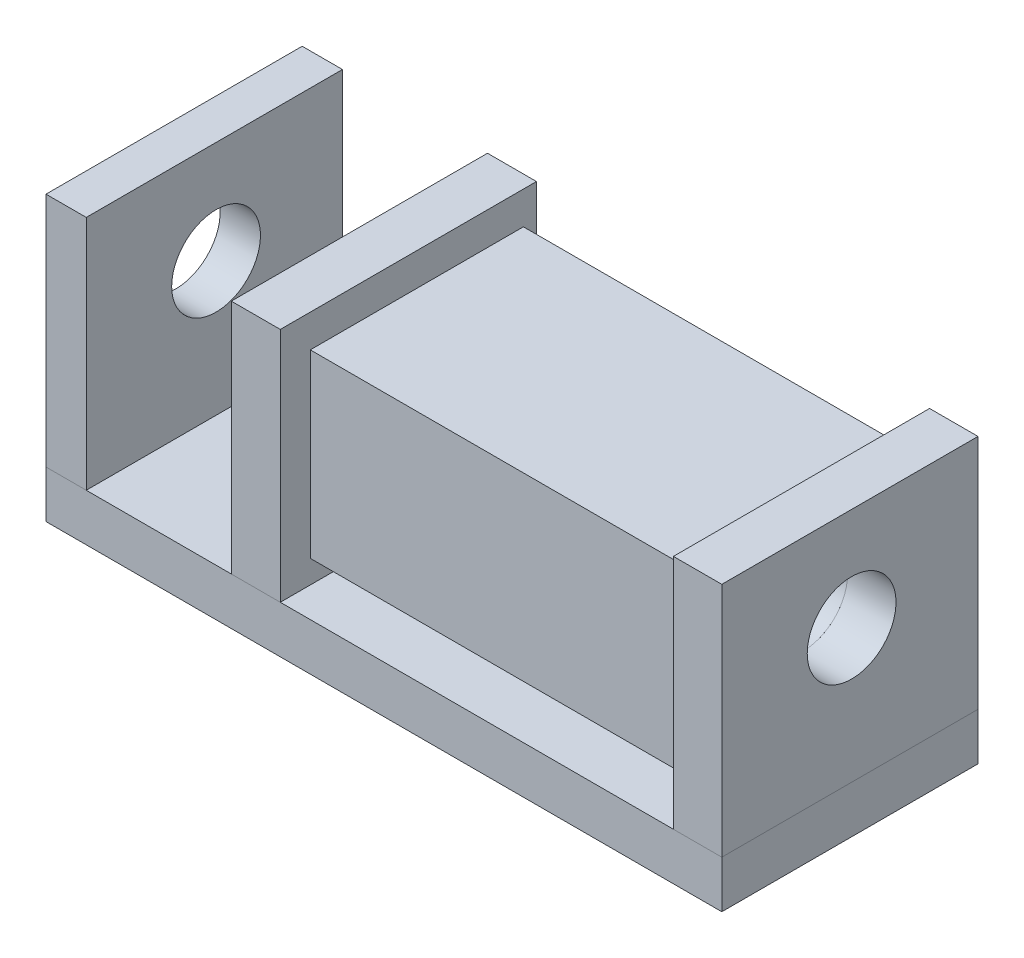
ISO-10303-21;
HEADER;
FILE_DESCRIPTION(('STEP AP214'),'2;1');
FILE_NAME('part.step','',(''),(''),'','','');
FILE_SCHEMA(('AUTOMOTIVE_DESIGN { 1 0 10303 214 1 1 1 1 }'));
ENDSEC;
DATA;
#1=APPLICATION_CONTEXT('core data for automotive mechanical design processes');
#2=APPLICATION_PROTOCOL_DEFINITION('international standard','automotive_design',2000,#1);
#3=PRODUCT_CONTEXT('',#1,'mechanical');
#4=PRODUCT('Part','Part','',(#3));
#5=PRODUCT_RELATED_PRODUCT_CATEGORY('part','',(#4));
#6=PRODUCT_DEFINITION_FORMATION('','',#4);
#7=PRODUCT_DEFINITION_CONTEXT('part definition',#1,'design');
#8=PRODUCT_DEFINITION('design','',#6,#7);
#9=PRODUCT_DEFINITION_SHAPE('','',#8);
#10=(LENGTH_UNIT() NAMED_UNIT(*) SI_UNIT(.MILLI.,.METRE.));
#11=(NAMED_UNIT(*) PLANE_ANGLE_UNIT() SI_UNIT($,.RADIAN.));
#12=(NAMED_UNIT(*) SI_UNIT($,.STERADIAN.) SOLID_ANGLE_UNIT());
#13=UNCERTAINTY_MEASURE_WITH_UNIT(LENGTH_MEASURE(1.E-05),#10,'distance_accuracy_value','');
#14=(GEOMETRIC_REPRESENTATION_CONTEXT(3) GLOBAL_UNCERTAINTY_ASSIGNED_CONTEXT((#13)) GLOBAL_UNIT_ASSIGNED_CONTEXT((#10,
#11,#12)) REPRESENTATION_CONTEXT('',''));
#15=CARTESIAN_POINT('',(0.,0.,0.));
#16=DIRECTION('',(0.,0.,1.));
#17=DIRECTION('',(1.,0.,0.));
#18=AXIS2_PLACEMENT_3D('',#15,#16,#17);
#19=CARTESIAN_POINT('',(132.746933466122,60.,0.));
#20=DIRECTION('',(1.,0.,0.));
#21=DIRECTION('',(0.,0.,-1.));
#22=AXIS2_PLACEMENT_3D('',#19,#20,#21);
#23=PLANE('',#22);
#24=CARTESIAN_POINT('',(132.746933466122,38.2969215715457,-27.4639647561201));
#25=DIRECTION('',(1.,0.,0.));
#26=DIRECTION('',(0.,0.,-1.));
#27=AXIS2_PLACEMENT_3D('',#24,#25,#26);
#28=CIRCLE('',#27,9.39188455367871);
#29=CARTESIAN_POINT('',(132.746933466122,38.2969215715457,-36.8558493097988));
#30=VERTEX_POINT('',#29);
#31=EDGE_CURVE('E103',#30,#30,#28,.T.);
#32=ORIENTED_EDGE('',*,*,#31,.F.);
#33=EDGE_LOOP('',(#32));
#34=FACE_BOUND('',#33,.T.);
#35=DIRECTION('',(0.,-1.,0.));
#36=VECTOR('',#35,1.);
#37=CARTESIAN_POINT('',(132.746933466137,53.0819568307948,-6.34781427334019));
#38=LINE('',#37,#36);
#39=CARTESIAN_POINT('',(132.746933466137,53.0819568307948,-6.34781427334019));
#40=VERTEX_POINT('',#39);
#41=CARTESIAN_POINT('',(132.746933466137,14.8769483537876,-6.34781427334019));
#42=VERTEX_POINT('',#41);
#43=EDGE_CURVE('E87',#40,#42,#38,.T.);
#44=ORIENTED_EDGE('',*,*,#43,.T.);
#45=DIRECTION('',(0.,0.,-1.));
#46=VECTOR('',#45,1.);
#47=CARTESIAN_POINT('',(132.746933466137,14.8769483537876,-6.34781427334019));
#48=LINE('',#47,#46);
#49=CARTESIAN_POINT('',(132.746933466137,14.8769483537876,-51.4371231705013));
#50=VERTEX_POINT('',#49);
#51=EDGE_CURVE('E116',#42,#50,#48,.T.);
#52=ORIENTED_EDGE('',*,*,#51,.T.);
#53=DIRECTION('',(0.,1.,0.));
#54=VECTOR('',#53,1.);
#55=CARTESIAN_POINT('',(132.746933466137,53.0819568307948,-51.4371231705013));
#56=LINE('',#55,#54);
#57=CARTESIAN_POINT('',(132.746933466137,53.0819568307948,-51.4371231705013));
#58=VERTEX_POINT('',#57);
#59=EDGE_CURVE('E51',#50,#58,#56,.T.);
#60=ORIENTED_EDGE('',*,*,#59,.T.);
#61=DIRECTION('',(0.,0.,1.));
#62=VECTOR('',#61,1.);
#63=CARTESIAN_POINT('',(132.746933466137,53.0819568307948,-6.34781427334019));
#64=LINE('',#63,#62);
#65=EDGE_CURVE('E12',#58,#40,#64,.T.);
#66=ORIENTED_EDGE('',*,*,#65,.T.);
#67=EDGE_LOOP('',(#44,#52,#60,#66));
#68=FACE_BOUND('',#67,.T.);
#69=ADVANCED_FACE('F43',(#34,#68),#23,.T.);
#70=CARTESIAN_POINT('',(500000.,14.8769483537876,-6.34781427334019));
#71=DIRECTION('',(0.,1.,0.));
#72=DIRECTION('',(0.,0.,1.));
#73=AXIS2_PLACEMENT_3D('',#70,#71,#72);
#74=PLANE('',#73);
#75=ORIENTED_EDGE('',*,*,#51,.F.);
#76=DIRECTION('',(-1.,0.,0.));
#77=VECTOR('',#76,1.);
#78=CARTESIAN_POINT('',(500000.,14.8769483537876,-6.34781427334019));
#79=LINE('',#78,#77);
#80=CARTESIAN_POINT('',(49.5738244185297,14.8769483537876,-6.34781427334019));
#81=VERTEX_POINT('',#80);
#82=EDGE_CURVE('E110',#42,#81,#79,.T.);
#83=ORIENTED_EDGE('',*,*,#82,.T.);
#84=DIRECTION('',(0.,0.,-1.));
#85=VECTOR('',#84,1.);
#86=CARTESIAN_POINT('',(49.5738244185297,14.8769483537876,-6.34781427334019));
#87=LINE('',#86,#85);
#88=CARTESIAN_POINT('',(49.5738244185297,14.8769483537876,-51.4371231705013));
#89=VERTEX_POINT('',#88);
#90=EDGE_CURVE('E102',#81,#89,#87,.T.);
#91=ORIENTED_EDGE('',*,*,#90,.T.);
#92=DIRECTION('',(-1.,0.,0.));
#93=VECTOR('',#92,1.);
#94=CARTESIAN_POINT('',(500000.,14.8769483537876,-51.4371231705013));
#95=LINE('',#94,#93);
#96=EDGE_CURVE('E112',#50,#89,#95,.T.);
#97=ORIENTED_EDGE('',*,*,#96,.F.);
#98=EDGE_LOOP('',(#75,#83,#91,#97));
#99=FACE_BOUND('',#98,.T.);
#100=ADVANCED_FACE('F120',(#99),#74,.F.);
#101=CARTESIAN_POINT('',(500000.,53.0819568307948,-6.34781427334019));
#102=DIRECTION('',(0.,0.,-1.));
#103=DIRECTION('',(-1.,0.,0.));
#104=AXIS2_PLACEMENT_3D('',#101,#102,#103);
#105=PLANE('',#104);
#106=ORIENTED_EDGE('',*,*,#43,.F.);
#107=DIRECTION('',(-1.,0.,0.));
#108=VECTOR('',#107,1.);
#109=CARTESIAN_POINT('',(500000.,53.0819568307948,-6.34781427334019));
#110=LINE('',#109,#108);
#111=CARTESIAN_POINT('',(49.5738244185297,53.0819568307948,-6.34781427334019));
#112=VERTEX_POINT('',#111);
#113=EDGE_CURVE('E81',#40,#112,#110,.T.);
#114=ORIENTED_EDGE('',*,*,#113,.T.);
#115=DIRECTION('',(0.,-1.,0.));
#116=VECTOR('',#115,1.);
#117=CARTESIAN_POINT('',(49.5738244185297,53.0819568307948,-6.34781427334019));
#118=LINE('',#117,#116);
#119=EDGE_CURVE('E86',#112,#81,#118,.T.);
#120=ORIENTED_EDGE('',*,*,#119,.T.);
#121=ORIENTED_EDGE('',*,*,#82,.F.);
#122=EDGE_LOOP('',(#106,#114,#120,#121));
#123=FACE_BOUND('',#122,.T.);
#124=ADVANCED_FACE('F83',(#123),#105,.F.);
#125=CARTESIAN_POINT('',(49.5738244185297,0.,0.));
#126=DIRECTION('',(1.,0.,0.));
#127=DIRECTION('',(0.,0.,-1.));
#128=AXIS2_PLACEMENT_3D('',#125,#126,#127);
#129=PLANE('',#128);
#130=CARTESIAN_POINT('',(49.5738244185297,38.2969215715457,-27.4639647561201));
#131=DIRECTION('',(1.,0.,0.));
#132=DIRECTION('',(0.,0.,-1.));
#133=AXIS2_PLACEMENT_3D('',#130,#131,#132);
#134=CIRCLE('',#133,9.39188455367871);
#135=CARTESIAN_POINT('',(49.5738244185297,38.2969215715457,-36.8558493097988));
#136=VERTEX_POINT('',#135);
#137=EDGE_CURVE('E46',#136,#136,#134,.T.);
#138=ORIENTED_EDGE('',*,*,#137,.T.);
#139=EDGE_LOOP('',(#138));
#140=FACE_BOUND('',#139,.T.);
#141=ORIENTED_EDGE('',*,*,#119,.F.);
#142=DIRECTION('',(0.,0.,1.));
#143=VECTOR('',#142,1.);
#144=CARTESIAN_POINT('',(49.5738244185297,53.0819568307948,-6.34781427334019));
#145=LINE('',#144,#143);
#146=CARTESIAN_POINT('',(49.5738244185297,53.0819568307948,-51.4371231705013));
#147=VERTEX_POINT('',#146);
#148=EDGE_CURVE('E89',#147,#112,#145,.T.);
#149=ORIENTED_EDGE('',*,*,#148,.F.);
#150=DIRECTION('',(0.,1.,0.));
#151=VECTOR('',#150,1.);
#152=CARTESIAN_POINT('',(49.5738244185297,53.0819568307948,-51.4371231705013));
#153=LINE('',#152,#151);
#154=EDGE_CURVE('E97',#89,#147,#153,.T.);
#155=ORIENTED_EDGE('',*,*,#154,.F.);
#156=ORIENTED_EDGE('',*,*,#90,.F.);
#157=EDGE_LOOP('',(#141,#149,#155,#156));
#158=FACE_BOUND('',#157,.T.);
#159=ADVANCED_FACE('F100',(#140,#158),#129,.F.);
#160=CARTESIAN_POINT('',(500000.,53.0819568307948,-51.4371231705013));
#161=DIRECTION('',(0.,0.,1.));
#162=DIRECTION('',(1.,0.,0.));
#163=AXIS2_PLACEMENT_3D('',#160,#161,#162);
#164=PLANE('',#163);
#165=ORIENTED_EDGE('',*,*,#59,.F.);
#166=ORIENTED_EDGE('',*,*,#96,.T.);
#167=ORIENTED_EDGE('',*,*,#154,.T.);
#168=DIRECTION('',(-1.,0.,0.));
#169=VECTOR('',#168,1.);
#170=CARTESIAN_POINT('',(500000.,53.0819568307948,-51.4371231705013));
#171=LINE('',#170,#169);
#172=EDGE_CURVE('E88',#58,#147,#171,.T.);
#173=ORIENTED_EDGE('',*,*,#172,.F.);
#174=EDGE_LOOP('',(#165,#166,#167,#173));
#175=FACE_BOUND('',#174,.T.);
#176=ADVANCED_FACE('F122',(#175),#164,.F.);
#177=CARTESIAN_POINT('',(500000.,53.0819568307948,-6.34781427334019));
#178=DIRECTION('',(0.,-1.,0.));
#179=DIRECTION('',(0.,0.,-1.));
#180=AXIS2_PLACEMENT_3D('',#177,#178,#179);
#181=PLANE('',#180);
#182=ORIENTED_EDGE('',*,*,#65,.F.);
#183=ORIENTED_EDGE('',*,*,#172,.T.);
#184=ORIENTED_EDGE('',*,*,#148,.T.);
#185=ORIENTED_EDGE('',*,*,#113,.F.);
#186=EDGE_LOOP('',(#182,#183,#184,#185));
#187=FACE_BOUND('',#186,.T.);
#188=ADVANCED_FACE('F92',(#187),#181,.F.);
#189=CARTESIAN_POINT('',(169.557159039612,38.2969215715457,-27.4639647561201));
#190=DIRECTION('',(-1.,0.,0.));
#191=DIRECTION('',(0.,0.,1.));
#192=AXIS2_PLACEMENT_3D('',#189,#190,#191);
#193=CYLINDRICAL_SURFACE('',#192,9.39188455367871);
#194=ORIENTED_EDGE('',*,*,#31,.T.);
#195=EDGE_LOOP('',(#194));
#196=FACE_BOUND('',#195,.T.);
#197=ORIENTED_EDGE('',*,*,#137,.F.);
#198=EDGE_LOOP('',(#197));
#199=FACE_BOUND('',#198,.T.);
#200=ADVANCED_FACE('F129',(#196,#199),#193,.F.);
#201=CLOSED_SHELL('',(#69,#100,#124,#159,#176,#188,#200));
#202=MANIFOLD_SOLID_BREP('B2',#201);
#203=CARTESIAN_POINT('',(39.2104018854431,60.,-54.2064580712363));
#204=DIRECTION('',(1.,0.,0.));
#205=DIRECTION('',(0.,0.,-1.));
#206=AXIS2_PLACEMENT_3D('',#203,#204,#205);
#207=PLANE('',#206);
#208=CARTESIAN_POINT('',(39.2104018854431,38.2969215715457,-27.4639647561201));
#209=DIRECTION('',(1.,0.,0.));
#210=DIRECTION('',(0.,0.,-1.));
#211=AXIS2_PLACEMENT_3D('',#208,#209,#210);
#212=CIRCLE('',#211,9.39188455367871);
#213=CARTESIAN_POINT('',(39.2104018854431,38.2969215715457,-36.8558493097988));
#214=VERTEX_POINT('',#213);
#215=EDGE_CURVE('E265',#214,#214,#212,.T.);
#216=ORIENTED_EDGE('',*,*,#215,.T.);
#217=EDGE_LOOP('',(#216));
#218=FACE_BOUND('',#217,.T.);
#219=DIRECTION('',(0.,0.,1.));
#220=VECTOR('',#219,1.);
#221=CARTESIAN_POINT('',(39.2104018854431,10.,-54.2064580712363));
#222=LINE('',#221,#220);
#223=CARTESIAN_POINT('',(39.2104018854431,10.,-54.2064580712363));
#224=VERTEX_POINT('',#223);
#225=CARTESIAN_POINT('',(39.2104018854431,10.,0.));
#226=VERTEX_POINT('',#225);
#227=EDGE_CURVE('E262',#224,#226,#222,.T.);
#228=ORIENTED_EDGE('',*,*,#227,.T.);
#229=DIRECTION('',(0.,-1.,0.));
#230=VECTOR('',#229,1.);
#231=CARTESIAN_POINT('',(39.2104018854431,60.,0.));
#232=LINE('',#231,#230);
#233=CARTESIAN_POINT('',(39.2104018854431,60.,0.));
#234=VERTEX_POINT('',#233);
#235=EDGE_CURVE('E41',#234,#226,#232,.T.);
#236=ORIENTED_EDGE('',*,*,#235,.F.);
#237=DIRECTION('',(0.,0.,1.));
#238=VECTOR('',#237,1.);
#239=CARTESIAN_POINT('',(39.2104018854431,60.,-54.2064580712363));
#240=LINE('',#239,#238);
#241=CARTESIAN_POINT('',(39.2104018854431,60.,-54.2064580712363));
#242=VERTEX_POINT('',#241);
#243=EDGE_CURVE('E249',#242,#234,#240,.T.);
#244=ORIENTED_EDGE('',*,*,#243,.F.);
#245=DIRECTION('',(0.,-1.,0.));
#246=VECTOR('',#245,1.);
#247=CARTESIAN_POINT('',(39.2104018854431,60.,-54.2064580712363));
#248=LINE('',#247,#246);
#249=EDGE_CURVE('E258',#242,#224,#248,.T.);
#250=ORIENTED_EDGE('',*,*,#249,.T.);
#251=EDGE_LOOP('',(#228,#236,#244,#250));
#252=FACE_BOUND('',#251,.T.);
#253=ADVANCED_FACE('F197',(#218,#252),#207,.F.);
#254=CARTESIAN_POINT('',(39.2104018854431,60.,0.));
#255=DIRECTION('',(0.,0.,-1.));
#256=DIRECTION('',(-1.,0.,0.));
#257=AXIS2_PLACEMENT_3D('',#254,#255,#256);
#258=PLANE('',#257);
#259=DIRECTION('',(1.,0.,0.));
#260=VECTOR('',#259,1.);
#261=CARTESIAN_POINT('',(39.2104018854431,10.,0.));
#262=LINE('',#261,#260);
#263=CARTESIAN_POINT('',(49.5738244185297,10.,0.));
#264=VERTEX_POINT('',#263);
#265=EDGE_CURVE('E253',#226,#264,#262,.T.);
#266=ORIENTED_EDGE('',*,*,#265,.T.);
#267=DIRECTION('',(0.,-1.,0.));
#268=VECTOR('',#267,1.);
#269=CARTESIAN_POINT('',(49.5738244185297,60.,0.));
#270=LINE('',#269,#268);
#271=CARTESIAN_POINT('',(49.5738244185297,60.,0.));
#272=VERTEX_POINT('',#271);
#273=EDGE_CURVE('E206',#272,#264,#270,.T.);
#274=ORIENTED_EDGE('',*,*,#273,.F.);
#275=DIRECTION('',(1.,0.,0.));
#276=VECTOR('',#275,1.);
#277=CARTESIAN_POINT('',(39.2104018854431,60.,0.));
#278=LINE('',#277,#276);
#279=EDGE_CURVE('E244',#234,#272,#278,.T.);
#280=ORIENTED_EDGE('',*,*,#279,.F.);
#281=ORIENTED_EDGE('',*,*,#235,.T.);
#282=EDGE_LOOP('',(#266,#274,#280,#281));
#283=FACE_BOUND('',#282,.T.);
#284=ADVANCED_FACE('F252',(#283),#258,.F.);
#285=CARTESIAN_POINT('',(49.5738244185297,60.,-54.2064580712363));
#286=DIRECTION('',(-1.,0.,0.));
#287=DIRECTION('',(0.,0.,1.));
#288=AXIS2_PLACEMENT_3D('',#285,#286,#287);
#289=PLANE('',#288);
#290=CARTESIAN_POINT('',(49.5738244185297,38.2969215715457,-27.4639647561201));
#291=DIRECTION('',(-1.,0.,0.));
#292=DIRECTION('',(0.,0.,1.));
#293=AXIS2_PLACEMENT_3D('',#290,#291,#292);
#294=CIRCLE('',#293,9.39188455367871);
#295=CARTESIAN_POINT('',(49.5738244185297,38.2969215715457,-18.0720802024414));
#296=VERTEX_POINT('',#295);
#297=EDGE_CURVE('E200',#296,#296,#294,.T.);
#298=ORIENTED_EDGE('',*,*,#297,.T.);
#299=EDGE_LOOP('',(#298));
#300=FACE_BOUND('',#299,.T.);
#301=DIRECTION('',(0.,0.,-1.));
#302=VECTOR('',#301,1.);
#303=CARTESIAN_POINT('',(49.5738244185297,10.,-54.2064580712363));
#304=LINE('',#303,#302);
#305=CARTESIAN_POINT('',(49.5738244185297,10.,-54.2064580712363));
#306=VERTEX_POINT('',#305);
#307=EDGE_CURVE('E231',#264,#306,#304,.T.);
#308=ORIENTED_EDGE('',*,*,#307,.T.);
#309=DIRECTION('',(0.,-1.,0.));
#310=VECTOR('',#309,1.);
#311=CARTESIAN_POINT('',(49.5738244185297,60.,-54.2064580712363));
#312=LINE('',#311,#310);
#313=CARTESIAN_POINT('',(49.5738244185297,60.,-54.2064580712363));
#314=VERTEX_POINT('',#313);
#315=EDGE_CURVE('E254',#314,#306,#312,.T.);
#316=ORIENTED_EDGE('',*,*,#315,.F.);
#317=DIRECTION('',(0.,0.,-1.));
#318=VECTOR('',#317,1.);
#319=CARTESIAN_POINT('',(49.5738244185297,60.,-54.2064580712363));
#320=LINE('',#319,#318);
#321=EDGE_CURVE('E247',#272,#314,#320,.T.);
#322=ORIENTED_EDGE('',*,*,#321,.F.);
#323=ORIENTED_EDGE('',*,*,#273,.T.);
#324=EDGE_LOOP('',(#308,#316,#322,#323));
#325=FACE_BOUND('',#324,.T.);
#326=ADVANCED_FACE('F256',(#300,#325),#289,.F.);
#327=CARTESIAN_POINT('',(39.2104018854431,60.,-54.2064580712363));
#328=DIRECTION('',(0.,0.,1.));
#329=DIRECTION('',(1.,0.,0.));
#330=AXIS2_PLACEMENT_3D('',#327,#328,#329);
#331=PLANE('',#330);
#332=DIRECTION('',(-1.,0.,0.));
#333=VECTOR('',#332,1.);
#334=CARTESIAN_POINT('',(39.2104018854431,10.,-54.2064580712363));
#335=LINE('',#334,#333);
#336=EDGE_CURVE('E237',#306,#224,#335,.T.);
#337=ORIENTED_EDGE('',*,*,#336,.T.);
#338=ORIENTED_EDGE('',*,*,#249,.F.);
#339=DIRECTION('',(-1.,0.,0.));
#340=VECTOR('',#339,1.);
#341=CARTESIAN_POINT('',(39.2104018854431,60.,-54.2064580712363));
#342=LINE('',#341,#340);
#343=EDGE_CURVE('E214',#314,#242,#342,.T.);
#344=ORIENTED_EDGE('',*,*,#343,.F.);
#345=ORIENTED_EDGE('',*,*,#315,.T.);
#346=EDGE_LOOP('',(#337,#338,#344,#345));
#347=FACE_BOUND('',#346,.T.);
#348=ADVANCED_FACE('F270',(#347),#331,.F.);
#349=CARTESIAN_POINT('',(0.,60.,0.));
#350=DIRECTION('',(0.,1.,0.));
#351=DIRECTION('',(0.,0.,1.));
#352=AXIS2_PLACEMENT_3D('',#349,#350,#351);
#353=PLANE('',#352);
#354=ORIENTED_EDGE('',*,*,#243,.T.);
#355=ORIENTED_EDGE('',*,*,#279,.T.);
#356=ORIENTED_EDGE('',*,*,#321,.T.);
#357=ORIENTED_EDGE('',*,*,#343,.T.);
#358=EDGE_LOOP('',(#354,#355,#356,#357));
#359=FACE_BOUND('',#358,.T.);
#360=ADVANCED_FACE('F245',(#359),#353,.T.);
#361=CARTESIAN_POINT('',(0.,10.,0.));
#362=DIRECTION('',(0.,1.,0.));
#363=DIRECTION('',(0.,0.,1.));
#364=AXIS2_PLACEMENT_3D('',#361,#362,#363);
#365=PLANE('',#364);
#366=ORIENTED_EDGE('',*,*,#227,.F.);
#367=ORIENTED_EDGE('',*,*,#336,.F.);
#368=ORIENTED_EDGE('',*,*,#307,.F.);
#369=ORIENTED_EDGE('',*,*,#265,.F.);
#370=EDGE_LOOP('',(#366,#367,#368,#369));
#371=FACE_BOUND('',#370,.T.);
#372=ADVANCED_FACE('F273',(#371),#365,.F.);
#373=CARTESIAN_POINT('',(169.557159039612,38.2969215715457,-27.4639647561201));
#374=DIRECTION('',(-1.,0.,0.));
#375=DIRECTION('',(0.,0.,1.));
#376=AXIS2_PLACEMENT_3D('',#373,#374,#375);
#377=CYLINDRICAL_SURFACE('',#376,9.39188455367871);
#378=ORIENTED_EDGE('',*,*,#297,.F.);
#379=EDGE_LOOP('',(#378));
#380=FACE_BOUND('',#379,.T.);
#381=ORIENTED_EDGE('',*,*,#215,.F.);
#382=EDGE_LOOP('',(#381));
#383=FACE_BOUND('',#382,.T.);
#384=ADVANCED_FACE('F283',(#380,#383),#377,.F.);
#385=CLOSED_SHELL('',(#253,#284,#326,#348,#360,#372,#384));
#386=MANIFOLD_SOLID_BREP('B6',#385);
#387=CARTESIAN_POINT('',(142.992898015503,60.,0.));
#388=DIRECTION('',(-1.,0.,0.));
#389=DIRECTION('',(0.,0.,1.));
#390=AXIS2_PLACEMENT_3D('',#387,#388,#389);
#391=PLANE('',#390);
#392=CARTESIAN_POINT('',(142.992898015503,38.2969215715457,-27.4639647561201));
#393=DIRECTION('',(-1.,0.,0.));
#394=DIRECTION('',(0.,0.,1.));
#395=AXIS2_PLACEMENT_3D('',#392,#393,#394);
#396=CIRCLE('',#395,9.39188455367871);
#397=CARTESIAN_POINT('',(142.992898015503,38.2969215715457,-18.0720802024414));
#398=VERTEX_POINT('',#397);
#399=EDGE_CURVE('E429',#398,#398,#396,.F.);
#400=ORIENTED_EDGE('',*,*,#399,.F.);
#401=EDGE_LOOP('',(#400));
#402=FACE_BOUND('',#401,.T.);
#403=DIRECTION('',(0.,0.,-1.));
#404=VECTOR('',#403,1.);
#405=CARTESIAN_POINT('',(142.992898015503,10.,0.));
#406=LINE('',#405,#404);
#407=CARTESIAN_POINT('',(142.992898015503,10.,0.));
#408=VERTEX_POINT('',#407);
#409=CARTESIAN_POINT('',(142.992898015503,10.,-54.2064580712363));
#410=VERTEX_POINT('',#409);
#411=EDGE_CURVE('E416',#408,#410,#406,.T.);
#412=ORIENTED_EDGE('',*,*,#411,.T.);
#413=DIRECTION('',(0.,-1.,0.));
#414=VECTOR('',#413,1.);
#415=CARTESIAN_POINT('',(142.992898015503,60.,-54.2064580712363));
#416=LINE('',#415,#414);
#417=CARTESIAN_POINT('',(142.992898015503,60.,-54.2064580712363));
#418=VERTEX_POINT('',#417);
#419=EDGE_CURVE('E195',#418,#410,#416,.T.);
#420=ORIENTED_EDGE('',*,*,#419,.F.);
#421=DIRECTION('',(0.,0.,-1.));
#422=VECTOR('',#421,1.);
#423=CARTESIAN_POINT('',(142.992898015503,60.,0.));
#424=LINE('',#423,#422);
#425=CARTESIAN_POINT('',(142.992898015503,60.,0.));
#426=VERTEX_POINT('',#425);
#427=EDGE_CURVE('E403',#426,#418,#424,.T.);
#428=ORIENTED_EDGE('',*,*,#427,.F.);
#429=DIRECTION('',(0.,-1.,0.));
#430=VECTOR('',#429,1.);
#431=CARTESIAN_POINT('',(142.992898015503,60.,0.));
#432=LINE('',#431,#430);
#433=EDGE_CURVE('E412',#426,#408,#432,.T.);
#434=ORIENTED_EDGE('',*,*,#433,.T.);
#435=EDGE_LOOP('',(#412,#420,#428,#434));
#436=FACE_BOUND('',#435,.T.);
#437=ADVANCED_FACE('F351',(#402,#436),#391,.F.);
#438=CARTESIAN_POINT('',(142.992898015503,60.,-54.2064580712363));
#439=DIRECTION('',(0.,0.,1.));
#440=DIRECTION('',(1.,0.,0.));
#441=AXIS2_PLACEMENT_3D('',#438,#439,#440);
#442=PLANE('',#441);
#443=DIRECTION('',(-1.,0.,0.));
#444=VECTOR('',#443,1.);
#445=CARTESIAN_POINT('',(142.992898015503,10.,-54.2064580712363));
#446=LINE('',#445,#444);
#447=CARTESIAN_POINT('',(132.746933466122,10.,-54.2064580712363));
#448=VERTEX_POINT('',#447);
#449=EDGE_CURVE('E407',#410,#448,#446,.T.);
#450=ORIENTED_EDGE('',*,*,#449,.T.);
#451=DIRECTION('',(0.,-1.,0.));
#452=VECTOR('',#451,1.);
#453=CARTESIAN_POINT('',(132.746933466122,60.,-54.2064580712363));
#454=LINE('',#453,#452);
#455=CARTESIAN_POINT('',(132.746933466122,60.,-54.2064580712363));
#456=VERTEX_POINT('',#455);
#457=EDGE_CURVE('E360',#456,#448,#454,.T.);
#458=ORIENTED_EDGE('',*,*,#457,.F.);
#459=DIRECTION('',(-1.,0.,0.));
#460=VECTOR('',#459,1.);
#461=CARTESIAN_POINT('',(142.992898015503,60.,-54.2064580712363));
#462=LINE('',#461,#460);
#463=EDGE_CURVE('E398',#418,#456,#462,.T.);
#464=ORIENTED_EDGE('',*,*,#463,.F.);
#465=ORIENTED_EDGE('',*,*,#419,.T.);
#466=EDGE_LOOP('',(#450,#458,#464,#465));
#467=FACE_BOUND('',#466,.T.);
#468=ADVANCED_FACE('F406',(#467),#442,.F.);
#469=CARTESIAN_POINT('',(132.746933466122,60.,0.));
#470=DIRECTION('',(1.,0.,0.));
#471=DIRECTION('',(0.,0.,-1.));
#472=AXIS2_PLACEMENT_3D('',#469,#470,#471);
#473=PLANE('',#472);
#474=CARTESIAN_POINT('',(132.746933466122,38.2969215715457,-27.4639647561201));
#475=DIRECTION('',(1.,0.,0.));
#476=DIRECTION('',(0.,0.,-1.));
#477=AXIS2_PLACEMENT_3D('',#474,#475,#476);
#478=CIRCLE('',#477,9.39188455367871);
#479=CARTESIAN_POINT('',(132.746933466122,38.2969215715457,-36.8558493097988));
#480=VERTEX_POINT('',#479);
#481=EDGE_CURVE('E354',#480,#480,#478,.T.);
#482=ORIENTED_EDGE('',*,*,#481,.T.);
#483=EDGE_LOOP('',(#482));
#484=FACE_BOUND('',#483,.T.);
#485=DIRECTION('',(0.,0.,1.));
#486=VECTOR('',#485,1.);
#487=CARTESIAN_POINT('',(132.746933466122,10.,0.));
#488=LINE('',#487,#486);
#489=CARTESIAN_POINT('',(132.746933466122,10.,0.));
#490=VERTEX_POINT('',#489);
#491=EDGE_CURVE('E385',#448,#490,#488,.T.);
#492=ORIENTED_EDGE('',*,*,#491,.T.);
#493=DIRECTION('',(0.,-1.,0.));
#494=VECTOR('',#493,1.);
#495=CARTESIAN_POINT('',(132.746933466122,60.,0.));
#496=LINE('',#495,#494);
#497=CARTESIAN_POINT('',(132.746933466122,60.,0.));
#498=VERTEX_POINT('',#497);
#499=EDGE_CURVE('E408',#498,#490,#496,.T.);
#500=ORIENTED_EDGE('',*,*,#499,.F.);
#501=DIRECTION('',(0.,0.,1.));
#502=VECTOR('',#501,1.);
#503=CARTESIAN_POINT('',(132.746933466122,60.,0.));
#504=LINE('',#503,#502);
#505=EDGE_CURVE('E401',#456,#498,#504,.T.);
#506=ORIENTED_EDGE('',*,*,#505,.F.);
#507=ORIENTED_EDGE('',*,*,#457,.T.);
#508=EDGE_LOOP('',(#492,#500,#506,#507));
#509=FACE_BOUND('',#508,.T.);
#510=ADVANCED_FACE('F410',(#484,#509),#473,.F.);
#511=CARTESIAN_POINT('',(142.992898015503,60.,0.));
#512=DIRECTION('',(0.,0.,-1.));
#513=DIRECTION('',(-1.,0.,0.));
#514=AXIS2_PLACEMENT_3D('',#511,#512,#513);
#515=PLANE('',#514);
#516=DIRECTION('',(1.,0.,0.));
#517=VECTOR('',#516,1.);
#518=CARTESIAN_POINT('',(142.992898015503,10.,0.));
#519=LINE('',#518,#517);
#520=EDGE_CURVE('E391',#490,#408,#519,.T.);
#521=ORIENTED_EDGE('',*,*,#520,.T.);
#522=ORIENTED_EDGE('',*,*,#433,.F.);
#523=DIRECTION('',(1.,0.,0.));
#524=VECTOR('',#523,1.);
#525=CARTESIAN_POINT('',(142.992898015503,60.,0.));
#526=LINE('',#525,#524);
#527=EDGE_CURVE('E368',#498,#426,#526,.T.);
#528=ORIENTED_EDGE('',*,*,#527,.F.);
#529=ORIENTED_EDGE('',*,*,#499,.T.);
#530=EDGE_LOOP('',(#521,#522,#528,#529));
#531=FACE_BOUND('',#530,.T.);
#532=ADVANCED_FACE('F423',(#531),#515,.F.);
#533=CARTESIAN_POINT('',(0.,60.,0.));
#534=DIRECTION('',(0.,1.,0.));
#535=DIRECTION('',(0.,0.,1.));
#536=AXIS2_PLACEMENT_3D('',#533,#534,#535);
#537=PLANE('',#536);
#538=ORIENTED_EDGE('',*,*,#427,.T.);
#539=ORIENTED_EDGE('',*,*,#463,.T.);
#540=ORIENTED_EDGE('',*,*,#505,.T.);
#541=ORIENTED_EDGE('',*,*,#527,.T.);
#542=EDGE_LOOP('',(#538,#539,#540,#541));
#543=FACE_BOUND('',#542,.T.);
#544=ADVANCED_FACE('F399',(#543),#537,.T.);
#545=CARTESIAN_POINT('',(0.,10.,0.));
#546=DIRECTION('',(0.,1.,0.));
#547=DIRECTION('',(0.,0.,1.));
#548=AXIS2_PLACEMENT_3D('',#545,#546,#547);
#549=PLANE('',#548);
#550=ORIENTED_EDGE('',*,*,#411,.F.);
#551=ORIENTED_EDGE('',*,*,#520,.F.);
#552=ORIENTED_EDGE('',*,*,#491,.F.);
#553=ORIENTED_EDGE('',*,*,#449,.F.);
#554=EDGE_LOOP('',(#550,#551,#552,#553));
#555=FACE_BOUND('',#554,.T.);
#556=ADVANCED_FACE('F426',(#555),#549,.F.);
#557=CARTESIAN_POINT('',(169.557159039612,38.2969215715457,-27.4639647561201));
#558=DIRECTION('',(-1.,0.,0.));
#559=DIRECTION('',(0.,0.,1.));
#560=AXIS2_PLACEMENT_3D('',#557,#558,#559);
#561=CYLINDRICAL_SURFACE('',#560,9.39188455367871);
#562=ORIENTED_EDGE('',*,*,#399,.T.);
#563=EDGE_LOOP('',(#562));
#564=FACE_BOUND('',#563,.T.);
#565=ORIENTED_EDGE('',*,*,#481,.F.);
#566=EDGE_LOOP('',(#565));
#567=FACE_BOUND('',#566,.T.);
#568=ADVANCED_FACE('F437',(#564,#567),#561,.F.);
#569=CLOSED_SHELL('',(#437,#468,#510,#532,#544,#556,#568));
#570=MANIFOLD_SOLID_BREP('B35',#569);
#571=CARTESIAN_POINT('',(0.,60.,0.));
#572=DIRECTION('',(1.,0.,0.));
#573=DIRECTION('',(0.,0.,-1.));
#574=AXIS2_PLACEMENT_3D('',#571,#572,#573);
#575=PLANE('',#574);
#576=CARTESIAN_POINT('',(0.,38.2969215715457,-27.4639647561201));
#577=DIRECTION('',(-1.,0.,0.));
#578=DIRECTION('',(0.,0.,1.));
#579=AXIS2_PLACEMENT_3D('',#576,#577,#578);
#580=CIRCLE('',#579,9.39188455367871);
#581=CARTESIAN_POINT('',(0.,38.2969215715457,-18.0720802024414));
#582=VERTEX_POINT('',#581);
#583=EDGE_CURVE('E582',#582,#582,#580,.T.);
#584=ORIENTED_EDGE('',*,*,#583,.F.);
#585=EDGE_LOOP('',(#584));
#586=FACE_BOUND('',#585,.T.);
#587=DIRECTION('',(0.,0.,1.));
#588=VECTOR('',#587,1.);
#589=CARTESIAN_POINT('',(0.,10.,0.));
#590=LINE('',#589,#588);
#591=CARTESIAN_POINT('',(0.,10.,-54.2064580712363));
#592=VERTEX_POINT('',#591);
#593=CARTESIAN_POINT('',(0.,10.,0.));
#594=VERTEX_POINT('',#593);
#595=EDGE_CURVE('E569',#592,#594,#590,.T.);
#596=ORIENTED_EDGE('',*,*,#595,.T.);
#597=DIRECTION('',(0.,-1.,0.));
#598=VECTOR('',#597,1.);
#599=CARTESIAN_POINT('',(0.,60.,0.));
#600=LINE('',#599,#598);
#601=CARTESIAN_POINT('',(0.,60.,0.));
#602=VERTEX_POINT('',#601);
#603=EDGE_CURVE('E349',#602,#594,#600,.T.);
#604=ORIENTED_EDGE('',*,*,#603,.F.);
#605=DIRECTION('',(0.,0.,1.));
#606=VECTOR('',#605,1.);
#607=CARTESIAN_POINT('',(0.,60.,0.));
#608=LINE('',#607,#606);
#609=CARTESIAN_POINT('',(0.,60.,-54.2064580712363));
#610=VERTEX_POINT('',#609);
#611=EDGE_CURVE('E556',#610,#602,#608,.T.);
#612=ORIENTED_EDGE('',*,*,#611,.F.);
#613=DIRECTION('',(0.,-1.,0.));
#614=VECTOR('',#613,1.);
#615=CARTESIAN_POINT('',(0.,60.,-54.2064580712363));
#616=LINE('',#615,#614);
#617=EDGE_CURVE('E565',#610,#592,#616,.T.);
#618=ORIENTED_EDGE('',*,*,#617,.T.);
#619=EDGE_LOOP('',(#596,#604,#612,#618));
#620=FACE_BOUND('',#619,.T.);
#621=ADVANCED_FACE('F504',(#586,#620),#575,.F.);
#622=CARTESIAN_POINT('',(0.,60.,0.));
#623=DIRECTION('',(0.,0.,-1.));
#624=DIRECTION('',(-1.,0.,0.));
#625=AXIS2_PLACEMENT_3D('',#622,#623,#624);
#626=PLANE('',#625);
#627=DIRECTION('',(1.,0.,0.));
#628=VECTOR('',#627,1.);
#629=CARTESIAN_POINT('',(0.,10.,0.));
#630=LINE('',#629,#628);
#631=CARTESIAN_POINT('',(8.51872746053289,10.,0.));
#632=VERTEX_POINT('',#631);
#633=EDGE_CURVE('E560',#594,#632,#630,.T.);
#634=ORIENTED_EDGE('',*,*,#633,.T.);
#635=DIRECTION('',(0.,-1.,0.));
#636=VECTOR('',#635,1.);
#637=CARTESIAN_POINT('',(8.51872746053289,60.,0.));
#638=LINE('',#637,#636);
#639=CARTESIAN_POINT('',(8.51872746053289,60.,0.));
#640=VERTEX_POINT('',#639);
#641=EDGE_CURVE('E513',#640,#632,#638,.T.);
#642=ORIENTED_EDGE('',*,*,#641,.F.);
#643=DIRECTION('',(1.,0.,0.));
#644=VECTOR('',#643,1.);
#645=CARTESIAN_POINT('',(0.,60.,0.));
#646=LINE('',#645,#644);
#647=EDGE_CURVE('E551',#602,#640,#646,.T.);
#648=ORIENTED_EDGE('',*,*,#647,.F.);
#649=ORIENTED_EDGE('',*,*,#603,.T.);
#650=EDGE_LOOP('',(#634,#642,#648,#649));
#651=FACE_BOUND('',#650,.T.);
#652=ADVANCED_FACE('F559',(#651),#626,.F.);
#653=CARTESIAN_POINT('',(8.51872746053289,60.,0.));
#654=DIRECTION('',(-1.,0.,0.));
#655=DIRECTION('',(0.,0.,1.));
#656=AXIS2_PLACEMENT_3D('',#653,#654,#655);
#657=PLANE('',#656);
#658=CARTESIAN_POINT('',(8.51872746053289,38.2969215715457,-27.4639647561201));
#659=DIRECTION('',(-1.,0.,0.));
#660=DIRECTION('',(0.,0.,1.));
#661=AXIS2_PLACEMENT_3D('',#658,#659,#660);
#662=CIRCLE('',#661,9.39188455367871);
#663=CARTESIAN_POINT('',(8.51872746053289,38.2969215715457,-18.0720802024414));
#664=VERTEX_POINT('',#663);
#665=EDGE_CURVE('E507',#664,#664,#662,.T.);
#666=ORIENTED_EDGE('',*,*,#665,.T.);
#667=EDGE_LOOP('',(#666));
#668=FACE_BOUND('',#667,.T.);
#669=DIRECTION('',(0.,0.,-1.));
#670=VECTOR('',#669,1.);
#671=CARTESIAN_POINT('',(8.51872746053289,10.,0.));
#672=LINE('',#671,#670);
#673=CARTESIAN_POINT('',(8.51872746053289,10.,-54.2064580712363));
#674=VERTEX_POINT('',#673);
#675=EDGE_CURVE('E538',#632,#674,#672,.T.);
#676=ORIENTED_EDGE('',*,*,#675,.T.);
#677=DIRECTION('',(0.,-1.,0.));
#678=VECTOR('',#677,1.);
#679=CARTESIAN_POINT('',(8.51872746053289,60.,-54.2064580712363));
#680=LINE('',#679,#678);
#681=CARTESIAN_POINT('',(8.51872746053289,60.,-54.2064580712363));
#682=VERTEX_POINT('',#681);
#683=EDGE_CURVE('E561',#682,#674,#680,.T.);
#684=ORIENTED_EDGE('',*,*,#683,.F.);
#685=DIRECTION('',(0.,0.,-1.));
#686=VECTOR('',#685,1.);
#687=CARTESIAN_POINT('',(8.51872746053289,60.,0.));
#688=LINE('',#687,#686);
#689=EDGE_CURVE('E554',#640,#682,#688,.T.);
#690=ORIENTED_EDGE('',*,*,#689,.F.);
#691=ORIENTED_EDGE('',*,*,#641,.T.);
#692=EDGE_LOOP('',(#676,#684,#690,#691));
#693=FACE_BOUND('',#692,.T.);
#694=ADVANCED_FACE('F563',(#668,#693),#657,.F.);
#695=CARTESIAN_POINT('',(0.,60.,-54.2064580712363));
#696=DIRECTION('',(0.,0.,1.));
#697=DIRECTION('',(1.,0.,0.));
#698=AXIS2_PLACEMENT_3D('',#695,#696,#697);
#699=PLANE('',#698);
#700=DIRECTION('',(-1.,0.,0.));
#701=VECTOR('',#700,1.);
#702=CARTESIAN_POINT('',(0.,10.,-54.2064580712363));
#703=LINE('',#702,#701);
#704=EDGE_CURVE('E544',#674,#592,#703,.T.);
#705=ORIENTED_EDGE('',*,*,#704,.T.);
#706=ORIENTED_EDGE('',*,*,#617,.F.);
#707=DIRECTION('',(-1.,0.,0.));
#708=VECTOR('',#707,1.);
#709=CARTESIAN_POINT('',(0.,60.,-54.2064580712363));
#710=LINE('',#709,#708);
#711=EDGE_CURVE('E521',#682,#610,#710,.T.);
#712=ORIENTED_EDGE('',*,*,#711,.F.);
#713=ORIENTED_EDGE('',*,*,#683,.T.);
#714=EDGE_LOOP('',(#705,#706,#712,#713));
#715=FACE_BOUND('',#714,.T.);
#716=ADVANCED_FACE('F576',(#715),#699,.F.);
#717=CARTESIAN_POINT('',(0.,60.,0.));
#718=DIRECTION('',(0.,-1.,0.));
#719=DIRECTION('',(0.,0.,-1.));
#720=AXIS2_PLACEMENT_3D('',#717,#718,#719);
#721=PLANE('',#720);
#722=ORIENTED_EDGE('',*,*,#611,.T.);
#723=ORIENTED_EDGE('',*,*,#647,.T.);
#724=ORIENTED_EDGE('',*,*,#689,.T.);
#725=ORIENTED_EDGE('',*,*,#711,.T.);
#726=EDGE_LOOP('',(#722,#723,#724,#725));
#727=FACE_BOUND('',#726,.T.);
#728=ADVANCED_FACE('F552',(#727),#721,.F.);
#729=CARTESIAN_POINT('',(0.,10.,0.));
#730=DIRECTION('',(0.,-1.,0.));
#731=DIRECTION('',(0.,0.,-1.));
#732=AXIS2_PLACEMENT_3D('',#729,#730,#731);
#733=PLANE('',#732);
#734=ORIENTED_EDGE('',*,*,#595,.F.);
#735=ORIENTED_EDGE('',*,*,#704,.F.);
#736=ORIENTED_EDGE('',*,*,#675,.F.);
#737=ORIENTED_EDGE('',*,*,#633,.F.);
#738=EDGE_LOOP('',(#734,#735,#736,#737));
#739=FACE_BOUND('',#738,.T.);
#740=ADVANCED_FACE('F579',(#739),#733,.T.);
#741=CARTESIAN_POINT('',(169.557159039612,38.2969215715457,-27.4639647561201));
#742=DIRECTION('',(-1.,0.,0.));
#743=DIRECTION('',(0.,0.,1.));
#744=AXIS2_PLACEMENT_3D('',#741,#742,#743);
#745=CYLINDRICAL_SURFACE('',#744,9.39188455367871);
#746=ORIENTED_EDGE('',*,*,#583,.T.);
#747=EDGE_LOOP('',(#746));
#748=FACE_BOUND('',#747,.T.);
#749=ORIENTED_EDGE('',*,*,#665,.F.);
#750=EDGE_LOOP('',(#749));
#751=FACE_BOUND('',#750,.T.);
#752=ADVANCED_FACE('F590',(#748,#751),#745,.F.);
#753=CLOSED_SHELL('',(#621,#652,#694,#716,#728,#740,#752));
#754=MANIFOLD_SOLID_BREP('B189',#753);
#755=CARTESIAN_POINT('',(0.,10.,0.));
#756=DIRECTION('',(1.,0.,0.));
#757=DIRECTION('',(0.,0.,-1.));
#758=AXIS2_PLACEMENT_3D('',#755,#756,#757);
#759=PLANE('',#758);
#760=DIRECTION('',(0.,0.,1.));
#761=VECTOR('',#760,1.);
#762=CARTESIAN_POINT('',(0.,0.,0.));
#763=LINE('',#762,#761);
#764=CARTESIAN_POINT('',(0.,0.,-54.2064580712363));
#765=VERTEX_POINT('',#764);
#766=CARTESIAN_POINT('',(0.,0.,0.));
#767=VERTEX_POINT('',#766);
#768=EDGE_CURVE('E711',#765,#767,#763,.T.);
#769=ORIENTED_EDGE('',*,*,#768,.T.);
#770=DIRECTION('',(0.,-1.,0.));
#771=VECTOR('',#770,1.);
#772=CARTESIAN_POINT('',(0.,10.,0.));
#773=LINE('',#772,#771);
#774=CARTESIAN_POINT('',(0.,10.,0.));
#775=VERTEX_POINT('',#774);
#776=EDGE_CURVE('E502',#775,#767,#773,.T.);
#777=ORIENTED_EDGE('',*,*,#776,.F.);
#778=DIRECTION('',(0.,0.,1.));
#779=VECTOR('',#778,1.);
#780=CARTESIAN_POINT('',(0.,10.,0.));
#781=LINE('',#780,#779);
#782=CARTESIAN_POINT('',(0.,10.,-54.2064580712363));
#783=VERTEX_POINT('',#782);
#784=EDGE_CURVE('E699',#783,#775,#781,.T.);
#785=ORIENTED_EDGE('',*,*,#784,.F.);
#786=DIRECTION('',(0.,-1.,0.));
#787=VECTOR('',#786,1.);
#788=CARTESIAN_POINT('',(0.,10.,-54.2064580712363));
#789=LINE('',#788,#787);
#790=EDGE_CURVE('E707',#783,#765,#789,.T.);
#791=ORIENTED_EDGE('',*,*,#790,.T.);
#792=EDGE_LOOP('',(#769,#777,#785,#791));
#793=FACE_BOUND('',#792,.T.);
#794=ADVANCED_FACE('F648',(#793),#759,.F.);
#795=CARTESIAN_POINT('',(0.,10.,0.));
#796=DIRECTION('',(0.,0.,-1.));
#797=DIRECTION('',(-1.,0.,0.));
#798=AXIS2_PLACEMENT_3D('',#795,#796,#797);
#799=PLANE('',#798);
#800=DIRECTION('',(1.,0.,0.));
#801=VECTOR('',#800,1.);
#802=CARTESIAN_POINT('',(0.,0.,0.));
#803=LINE('',#802,#801);
#804=CARTESIAN_POINT('',(142.992898015503,0.,0.));
#805=VERTEX_POINT('',#804);
#806=EDGE_CURVE('E703',#767,#805,#803,.T.);
#807=ORIENTED_EDGE('',*,*,#806,.T.);
#808=DIRECTION('',(0.,-1.,0.));
#809=VECTOR('',#808,1.);
#810=CARTESIAN_POINT('',(142.992898015503,10.,0.));
#811=LINE('',#810,#809);
#812=CARTESIAN_POINT('',(142.992898015503,10.,0.));
#813=VERTEX_POINT('',#812);
#814=EDGE_CURVE('E656',#813,#805,#811,.T.);
#815=ORIENTED_EDGE('',*,*,#814,.F.);
#816=DIRECTION('',(1.,0.,0.));
#817=VECTOR('',#816,1.);
#818=CARTESIAN_POINT('',(0.,10.,0.));
#819=LINE('',#818,#817);
#820=EDGE_CURVE('E694',#775,#813,#819,.T.);
#821=ORIENTED_EDGE('',*,*,#820,.F.);
#822=ORIENTED_EDGE('',*,*,#776,.T.);
#823=EDGE_LOOP('',(#807,#815,#821,#822));
#824=FACE_BOUND('',#823,.T.);
#825=ADVANCED_FACE('F702',(#824),#799,.F.);
#826=CARTESIAN_POINT('',(142.992898015503,10.,0.));
#827=DIRECTION('',(-1.,0.,0.));
#828=DIRECTION('',(0.,0.,1.));
#829=AXIS2_PLACEMENT_3D('',#826,#827,#828);
#830=PLANE('',#829);
#831=DIRECTION('',(0.,0.,-1.));
#832=VECTOR('',#831,1.);
#833=CARTESIAN_POINT('',(142.992898015503,0.,0.));
#834=LINE('',#833,#832);
#835=CARTESIAN_POINT('',(142.992898015503,0.,-54.2064580712363));
#836=VERTEX_POINT('',#835);
#837=EDGE_CURVE('E681',#805,#836,#834,.T.);
#838=ORIENTED_EDGE('',*,*,#837,.T.);
#839=DIRECTION('',(0.,-1.,0.));
#840=VECTOR('',#839,1.);
#841=CARTESIAN_POINT('',(142.992898015503,10.,-54.2064580712363));
#842=LINE('',#841,#840);
#843=CARTESIAN_POINT('',(142.992898015503,10.,-54.2064580712363));
#844=VERTEX_POINT('',#843);
#845=EDGE_CURVE('E704',#844,#836,#842,.T.);
#846=ORIENTED_EDGE('',*,*,#845,.F.);
#847=DIRECTION('',(0.,0.,-1.));
#848=VECTOR('',#847,1.);
#849=CARTESIAN_POINT('',(142.992898015503,10.,0.));
#850=LINE('',#849,#848);
#851=EDGE_CURVE('E697',#813,#844,#850,.T.);
#852=ORIENTED_EDGE('',*,*,#851,.F.);
#853=ORIENTED_EDGE('',*,*,#814,.T.);
#854=EDGE_LOOP('',(#838,#846,#852,#853));
#855=FACE_BOUND('',#854,.T.);
#856=ADVANCED_FACE('F705',(#855),#830,.F.);
#857=CARTESIAN_POINT('',(0.,10.,-54.2064580712363));
#858=DIRECTION('',(0.,0.,1.));
#859=DIRECTION('',(1.,0.,0.));
#860=AXIS2_PLACEMENT_3D('',#857,#858,#859);
#861=PLANE('',#860);
#862=DIRECTION('',(-1.,0.,0.));
#863=VECTOR('',#862,1.);
#864=CARTESIAN_POINT('',(0.,0.,-54.2064580712363));
#865=LINE('',#864,#863);
#866=EDGE_CURVE('E687',#836,#765,#865,.T.);
#867=ORIENTED_EDGE('',*,*,#866,.T.);
#868=ORIENTED_EDGE('',*,*,#790,.F.);
#869=DIRECTION('',(-1.,0.,0.));
#870=VECTOR('',#869,1.);
#871=CARTESIAN_POINT('',(0.,10.,-54.2064580712363));
#872=LINE('',#871,#870);
#873=EDGE_CURVE('E664',#844,#783,#872,.T.);
#874=ORIENTED_EDGE('',*,*,#873,.F.);
#875=ORIENTED_EDGE('',*,*,#845,.T.);
#876=EDGE_LOOP('',(#867,#868,#874,#875));
#877=FACE_BOUND('',#876,.T.);
#878=ADVANCED_FACE('F718',(#877),#861,.F.);
#879=CARTESIAN_POINT('',(0.,10.,0.));
#880=DIRECTION('',(0.,-1.,0.));
#881=DIRECTION('',(0.,0.,-1.));
#882=AXIS2_PLACEMENT_3D('',#879,#880,#881);
#883=PLANE('',#882);
#884=ORIENTED_EDGE('',*,*,#784,.T.);
#885=ORIENTED_EDGE('',*,*,#820,.T.);
#886=ORIENTED_EDGE('',*,*,#851,.T.);
#887=ORIENTED_EDGE('',*,*,#873,.T.);
#888=EDGE_LOOP('',(#884,#885,#886,#887));
#889=FACE_BOUND('',#888,.T.);
#890=ADVANCED_FACE('F695',(#889),#883,.F.);
#891=CARTESIAN_POINT('',(0.,0.,0.));
#892=DIRECTION('',(0.,-1.,0.));
#893=DIRECTION('',(0.,0.,-1.));
#894=AXIS2_PLACEMENT_3D('',#891,#892,#893);
#895=PLANE('',#894);
#896=ORIENTED_EDGE('',*,*,#768,.F.);
#897=ORIENTED_EDGE('',*,*,#866,.F.);
#898=ORIENTED_EDGE('',*,*,#837,.F.);
#899=ORIENTED_EDGE('',*,*,#806,.F.);
#900=EDGE_LOOP('',(#896,#897,#898,#899));
#901=FACE_BOUND('',#900,.T.);
#902=ADVANCED_FACE('F721',(#901),#895,.T.);
#903=CLOSED_SHELL('',(#794,#825,#856,#878,#890,#902));
#904=MANIFOLD_SOLID_BREP('B343',#903);
#905=ADVANCED_BREP_SHAPE_REPRESENTATION('',(#18,#202,#386,#570,#754,#904),#14);
#906=SHAPE_DEFINITION_REPRESENTATION(#9,#905);
ENDSEC;
END-ISO-10303-21;
